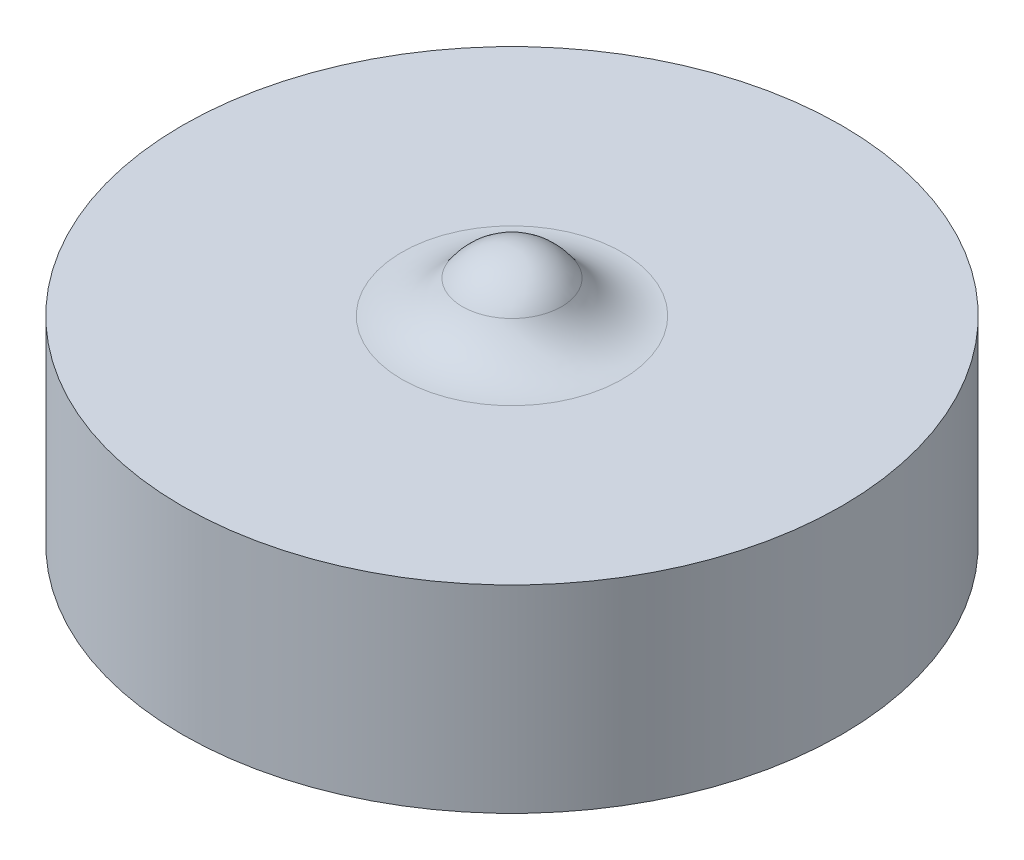
ISO-10303-21;
HEADER;
FILE_DESCRIPTION(('STEP AP214'),'2;1');
FILE_NAME('part.step','',(''),(''),'','','');
FILE_SCHEMA(('AUTOMOTIVE_DESIGN { 1 0 10303 214 1 1 1 1 }'));
ENDSEC;
DATA;
#1=APPLICATION_CONTEXT('core data for automotive mechanical design processes');
#2=APPLICATION_PROTOCOL_DEFINITION('international standard','automotive_design',2000,#1);
#3=PRODUCT_CONTEXT('',#1,'mechanical');
#4=PRODUCT('Part','Part','',(#3));
#5=PRODUCT_RELATED_PRODUCT_CATEGORY('part','',(#4));
#6=PRODUCT_DEFINITION_FORMATION('','',#4);
#7=PRODUCT_DEFINITION_CONTEXT('part definition',#1,'design');
#8=PRODUCT_DEFINITION('design','',#6,#7);
#9=PRODUCT_DEFINITION_SHAPE('','',#8);
#10=(LENGTH_UNIT() NAMED_UNIT(*) SI_UNIT(.MILLI.,.METRE.));
#11=(NAMED_UNIT(*) PLANE_ANGLE_UNIT() SI_UNIT($,.RADIAN.));
#12=(NAMED_UNIT(*) SI_UNIT($,.STERADIAN.) SOLID_ANGLE_UNIT());
#13=UNCERTAINTY_MEASURE_WITH_UNIT(LENGTH_MEASURE(1.E-05),#10,'distance_accuracy_value','');
#14=(GEOMETRIC_REPRESENTATION_CONTEXT(3) GLOBAL_UNCERTAINTY_ASSIGNED_CONTEXT((#13)) GLOBAL_UNIT_ASSIGNED_CONTEXT((#10,
#11,#12)) REPRESENTATION_CONTEXT('',''));
#15=CARTESIAN_POINT('',(0.,0.,0.));
#16=DIRECTION('',(0.,0.,1.));
#17=DIRECTION('',(1.,0.,0.));
#18=AXIS2_PLACEMENT_3D('',#15,#16,#17);
#19=CARTESIAN_POINT('',(0.,3.,0.));
#20=DIRECTION('',(0.,-1.,0.));
#21=DIRECTION('',(0.,0.,-1.));
#22=AXIS2_PLACEMENT_3D('',#19,#20,#21);
#23=CYLINDRICAL_SURFACE('',#22,5.);
#24=CARTESIAN_POINT('',(0.,3.,0.));
#25=DIRECTION('',(0.,1.,0.));
#26=DIRECTION('',(0.,0.,1.));
#27=AXIS2_PLACEMENT_3D('',#24,#25,#26);
#28=CIRCLE('',#27,5.);
#29=CARTESIAN_POINT('',(0.,3.,5.));
#30=VERTEX_POINT('',#29);
#31=EDGE_CURVE('E49',#30,#30,#28,.T.);
#32=ORIENTED_EDGE('',*,*,#31,.F.);
#33=EDGE_LOOP('',(#32));
#34=FACE_BOUND('',#33,.T.);
#35=CARTESIAN_POINT('',(0.,0.,0.));
#36=DIRECTION('',(0.,1.,0.));
#37=DIRECTION('',(0.,0.,1.));
#38=AXIS2_PLACEMENT_3D('',#35,#36,#37);
#39=CIRCLE('',#38,5.);
#40=CARTESIAN_POINT('',(0.,0.,5.));
#41=VERTEX_POINT('',#40);
#42=EDGE_CURVE('E53',#41,#41,#39,.T.);
#43=ORIENTED_EDGE('',*,*,#42,.T.);
#44=EDGE_LOOP('',(#43));
#45=FACE_BOUND('',#44,.T.);
#46=ADVANCED_FACE('F38',(#34,#45),#23,.T.);
#47=CARTESIAN_POINT('',(0.,3.,0.));
#48=DIRECTION('',(0.,1.,0.));
#49=DIRECTION('',(0.,0.,1.));
#50=AXIS2_PLACEMENT_3D('',#47,#48,#49);
#51=PLANE('',#50);
#52=CARTESIAN_POINT('',(0.,3.,0.));
#53=DIRECTION('',(0.,1.,0.));
#54=DIRECTION('',(0.,0.,1.));
#55=AXIS2_PLACEMENT_3D('',#52,#53,#54);
#56=CIRCLE('',#55,1.67032930884901);
#57=CARTESIAN_POINT('',(0.,3.,1.67032930884901));
#58=VERTEX_POINT('',#57);
#59=EDGE_CURVE('E11',#58,#58,#56,.F.);
#60=ORIENTED_EDGE('',*,*,#59,.T.);
#61=EDGE_LOOP('',(#60));
#62=FACE_BOUND('',#61,.T.);
#63=ORIENTED_EDGE('',*,*,#31,.T.);
#64=EDGE_LOOP('',(#63));
#65=FACE_BOUND('',#64,.T.);
#66=ADVANCED_FACE('F63',(#62,#65),#51,.T.);
#67=CARTESIAN_POINT('',(0.,0.,0.));
#68=DIRECTION('',(0.,1.,0.));
#69=DIRECTION('',(0.,0.,1.));
#70=AXIS2_PLACEMENT_3D('',#67,#68,#69);
#71=PLANE('',#70);
#72=ORIENTED_EDGE('',*,*,#42,.F.);
#73=EDGE_LOOP('',(#72));
#74=FACE_BOUND('',#73,.T.);
#75=ADVANCED_FACE('F60',(#74),#71,.F.);
#76=CARTESIAN_POINT('',(0.,3.,0.));
#77=DIRECTION('',(0.,-1.,0.));
#78=DIRECTION('',(1.,0.,0.));
#79=AXIS2_PLACEMENT_3D('',#76,#77,#78);
#80=SPHERICAL_SURFACE('',#79,0.9);
#81=CARTESIAN_POINT('',(0.,3.495,0.));
#82=DIRECTION('',(0.,-1.,0.));
#83=DIRECTION('',(0.,0.,-1.));
#84=AXIS2_PLACEMENT_3D('',#81,#82,#83);
#85=CIRCLE('',#84,0.751648188982053);
#86=CARTESIAN_POINT('',(0.,3.495,-0.751648188982053));
#87=VERTEX_POINT('',#86);
#88=EDGE_CURVE('E45',#87,#87,#85,.F.);
#89=ORIENTED_EDGE('',*,*,#88,.T.);
#90=EDGE_LOOP('',(#89));
#91=FACE_BOUND('',#90,.T.);
#92=ADVANCED_FACE('F62',(#91),#80,.T.);
#93=CARTESIAN_POINT('',(0.,4.1,0.));
#94=DIRECTION('',(0.,1.,0.));
#95=DIRECTION('',(0.,0.,1.));
#96=AXIS2_PLACEMENT_3D('',#93,#94,#95);
#97=TOROIDAL_SURFACE('',#96,1.67032930884901,1.1);
#98=ORIENTED_EDGE('',*,*,#59,.F.);
#99=EDGE_LOOP('',(#98));
#100=FACE_BOUND('',#99,.T.);
#101=ORIENTED_EDGE('',*,*,#88,.F.);
#102=EDGE_LOOP('',(#101));
#103=FACE_BOUND('',#102,.T.);
#104=ADVANCED_FACE('F40',(#100,#103),#97,.F.);
#105=CLOSED_SHELL('',(#46,#66,#75,#92,#104));
#106=MANIFOLD_SOLID_BREP('B2',#105);
#107=ADVANCED_BREP_SHAPE_REPRESENTATION('',(#18,#106),#14);
#108=SHAPE_DEFINITION_REPRESENTATION(#9,#107);
ENDSEC;
END-ISO-10303-21;
